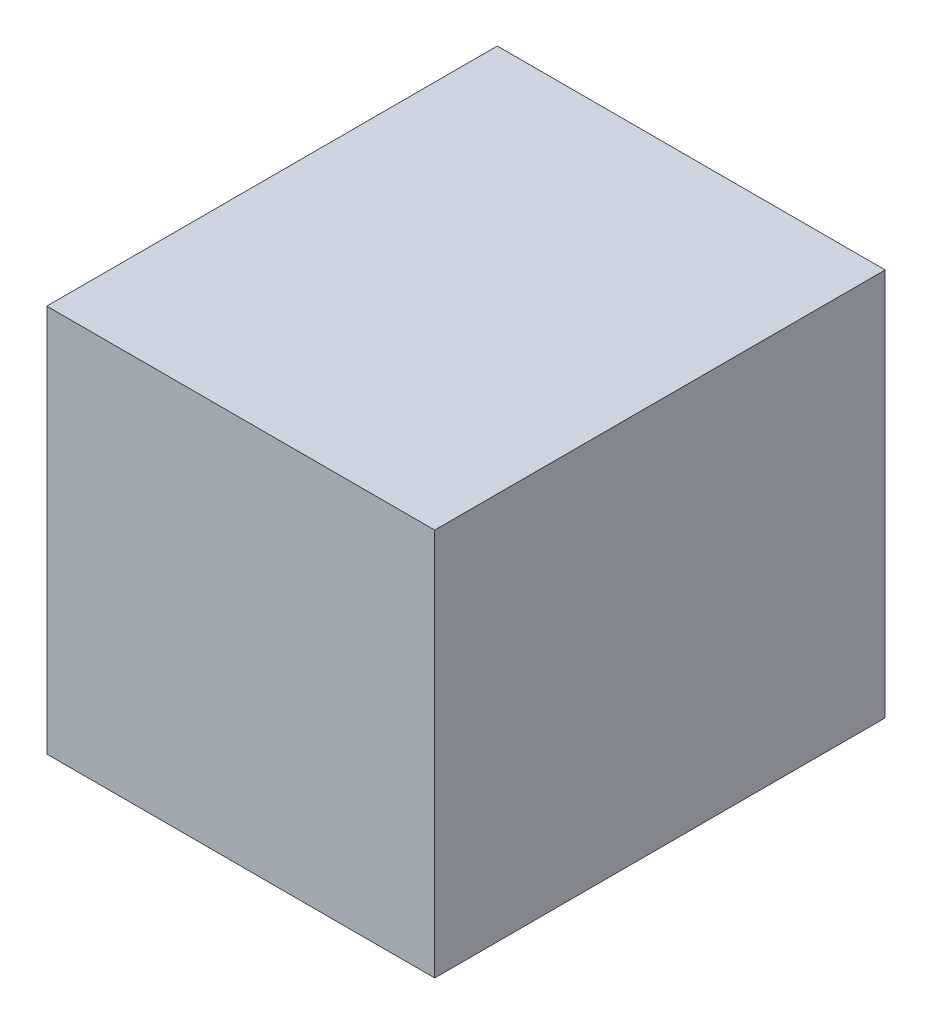
ISO-10303-21;
HEADER;
FILE_DESCRIPTION(('STEP AP214'),'2;1');
FILE_NAME('part.step','',(''),(''),'','','');
FILE_SCHEMA(('AUTOMOTIVE_DESIGN { 1 0 10303 214 1 1 1 1 }'));
ENDSEC;
DATA;
#1=APPLICATION_CONTEXT('core data for automotive mechanical design processes');
#2=APPLICATION_PROTOCOL_DEFINITION('international standard','automotive_design',2000,#1);
#3=PRODUCT_CONTEXT('',#1,'mechanical');
#4=PRODUCT('Part','Part','',(#3));
#5=PRODUCT_RELATED_PRODUCT_CATEGORY('part','',(#4));
#6=PRODUCT_DEFINITION_FORMATION('','',#4);
#7=PRODUCT_DEFINITION_CONTEXT('part definition',#1,'design');
#8=PRODUCT_DEFINITION('design','',#6,#7);
#9=PRODUCT_DEFINITION_SHAPE('','',#8);
#10=(LENGTH_UNIT() NAMED_UNIT(*) SI_UNIT(.MILLI.,.METRE.));
#11=(NAMED_UNIT(*) PLANE_ANGLE_UNIT() SI_UNIT($,.RADIAN.));
#12=(NAMED_UNIT(*) SI_UNIT($,.STERADIAN.) SOLID_ANGLE_UNIT());
#13=UNCERTAINTY_MEASURE_WITH_UNIT(LENGTH_MEASURE(1.E-05),#10,'distance_accuracy_value','');
#14=(GEOMETRIC_REPRESENTATION_CONTEXT(3) GLOBAL_UNCERTAINTY_ASSIGNED_CONTEXT((#13)) GLOBAL_UNIT_ASSIGNED_CONTEXT((#10,
#11,#12)) REPRESENTATION_CONTEXT('',''));
#15=CARTESIAN_POINT('',(0.,0.,0.));
#16=DIRECTION('',(0.,0.,1.));
#17=DIRECTION('',(1.,0.,0.));
#18=AXIS2_PLACEMENT_3D('',#15,#16,#17);
#19=CARTESIAN_POINT('',(-2.54,-5.08,0.2));
#20=DIRECTION('',(0.,1.,0.));
#21=DIRECTION('',(0.,0.,1.));
#22=AXIS2_PLACEMENT_3D('',#19,#20,#21);
#23=PLANE('',#22);
#24=DIRECTION('',(0.,0.,1.));
#25=VECTOR('',#24,1.);
#26=CARTESIAN_POINT('',(7.62,-5.08,0.2));
#27=LINE('',#26,#25);
#28=CARTESIAN_POINT('',(7.62,-5.08,0.2));
#29=VERTEX_POINT('',#28);
#30=CARTESIAN_POINT('',(7.62,-5.08,12.));
#31=VERTEX_POINT('',#30);
#32=EDGE_CURVE('E19',#29,#31,#27,.T.);
#33=ORIENTED_EDGE('',*,*,#32,.T.);
#34=DIRECTION('',(-1.,0.,0.));
#35=VECTOR('',#34,1.);
#36=CARTESIAN_POINT('',(7.62,-5.08,12.));
#37=LINE('',#36,#35);
#38=CARTESIAN_POINT('',(-2.54,-5.08,12.));
#39=VERTEX_POINT('',#38);
#40=EDGE_CURVE('E54',#31,#39,#37,.T.);
#41=ORIENTED_EDGE('',*,*,#40,.T.);
#42=DIRECTION('',(0.,0.,-1.));
#43=VECTOR('',#42,1.);
#44=CARTESIAN_POINT('',(-2.54,-5.08,0.2));
#45=LINE('',#44,#43);
#46=CARTESIAN_POINT('',(-2.54,-5.08,0.2));
#47=VERTEX_POINT('',#46);
#48=EDGE_CURVE('E75',#39,#47,#45,.T.);
#49=ORIENTED_EDGE('',*,*,#48,.T.);
#50=DIRECTION('',(-1.,0.,0.));
#51=VECTOR('',#50,1.);
#52=CARTESIAN_POINT('',(7.62,-5.08,0.2));
#53=LINE('',#52,#51);
#54=EDGE_CURVE('E57',#29,#47,#53,.T.);
#55=ORIENTED_EDGE('',*,*,#54,.F.);
#56=EDGE_LOOP('',(#33,#41,#49,#55));
#57=FACE_BOUND('',#56,.T.);
#58=ADVANCED_FACE('F16',(#57),#23,.F.);
#59=CARTESIAN_POINT('',(7.62,-5.08,0.2));
#60=DIRECTION('',(-1.,0.,0.));
#61=DIRECTION('',(0.,0.,1.));
#62=AXIS2_PLACEMENT_3D('',#59,#60,#61);
#63=PLANE('',#62);
#64=DIRECTION('',(0.,0.,-1.));
#65=VECTOR('',#64,1.);
#66=CARTESIAN_POINT('',(7.62,5.08,0.2));
#67=LINE('',#66,#65);
#68=CARTESIAN_POINT('',(7.62,5.08,0.2));
#69=VERTEX_POINT('',#68);
#70=CARTESIAN_POINT('',(7.62,5.08,12.));
#71=VERTEX_POINT('',#70);
#72=EDGE_CURVE('E72',#69,#71,#67,.F.);
#73=ORIENTED_EDGE('',*,*,#72,.T.);
#74=DIRECTION('',(0.,1.,0.));
#75=VECTOR('',#74,1.);
#76=CARTESIAN_POINT('',(7.62,5.08,12.));
#77=LINE('',#76,#75);
#78=EDGE_CURVE('E62',#71,#31,#77,.F.);
#79=ORIENTED_EDGE('',*,*,#78,.T.);
#80=ORIENTED_EDGE('',*,*,#32,.F.);
#81=DIRECTION('',(0.,1.,0.));
#82=VECTOR('',#81,1.);
#83=CARTESIAN_POINT('',(7.62,5.08,0.2));
#84=LINE('',#83,#82);
#85=EDGE_CURVE('E77',#69,#29,#84,.F.);
#86=ORIENTED_EDGE('',*,*,#85,.F.);
#87=EDGE_LOOP('',(#73,#79,#80,#86));
#88=FACE_BOUND('',#87,.T.);
#89=ADVANCED_FACE('F71',(#88),#63,.F.);
#90=CARTESIAN_POINT('',(7.62,5.08,12.));
#91=DIRECTION('',(0.,0.,-1.));
#92=DIRECTION('',(-1.,0.,0.));
#93=AXIS2_PLACEMENT_3D('',#90,#91,#92);
#94=PLANE('',#93);
#95=DIRECTION('',(0.,1.,0.));
#96=VECTOR('',#95,1.);
#97=CARTESIAN_POINT('',(-2.54,5.08,12.));
#98=LINE('',#97,#96);
#99=CARTESIAN_POINT('',(-2.54,5.08,12.));
#100=VERTEX_POINT('',#99);
#101=EDGE_CURVE('E68',#100,#39,#98,.F.);
#102=ORIENTED_EDGE('',*,*,#101,.T.);
#103=ORIENTED_EDGE('',*,*,#40,.F.);
#104=ORIENTED_EDGE('',*,*,#78,.F.);
#105=DIRECTION('',(1.,0.,0.));
#106=VECTOR('',#105,1.);
#107=CARTESIAN_POINT('',(7.62,5.08,12.));
#108=LINE('',#107,#106);
#109=EDGE_CURVE('E82',#71,#100,#108,.F.);
#110=ORIENTED_EDGE('',*,*,#109,.T.);
#111=EDGE_LOOP('',(#102,#103,#104,#110));
#112=FACE_BOUND('',#111,.T.);
#113=ADVANCED_FACE('F65',(#112),#94,.F.);
#114=CARTESIAN_POINT('',(-2.54,5.08,0.2));
#115=DIRECTION('',(1.,0.,0.));
#116=DIRECTION('',(0.,0.,-1.));
#117=AXIS2_PLACEMENT_3D('',#114,#115,#116);
#118=PLANE('',#117);
#119=ORIENTED_EDGE('',*,*,#48,.F.);
#120=ORIENTED_EDGE('',*,*,#101,.F.);
#121=DIRECTION('',(0.,0.,-1.));
#122=VECTOR('',#121,1.);
#123=CARTESIAN_POINT('',(-2.54,5.08,0.2));
#124=LINE('',#123,#122);
#125=CARTESIAN_POINT('',(-2.54,5.08,0.2));
#126=VERTEX_POINT('',#125);
#127=EDGE_CURVE('E25',#100,#126,#124,.T.);
#128=ORIENTED_EDGE('',*,*,#127,.T.);
#129=DIRECTION('',(0.,1.,0.));
#130=VECTOR('',#129,1.);
#131=CARTESIAN_POINT('',(-2.54,5.08,0.2));
#132=LINE('',#131,#130);
#133=EDGE_CURVE('E33',#47,#126,#132,.T.);
#134=ORIENTED_EDGE('',*,*,#133,.F.);
#135=EDGE_LOOP('',(#119,#120,#128,#134));
#136=FACE_BOUND('',#135,.T.);
#137=ADVANCED_FACE('F87',(#136),#118,.F.);
#138=CARTESIAN_POINT('',(7.62,5.08,0.2));
#139=DIRECTION('',(0.,0.,-1.));
#140=DIRECTION('',(-1.,0.,0.));
#141=AXIS2_PLACEMENT_3D('',#138,#139,#140);
#142=PLANE('',#141);
#143=ORIENTED_EDGE('',*,*,#133,.T.);
#144=DIRECTION('',(1.,0.,0.));
#145=VECTOR('',#144,1.);
#146=CARTESIAN_POINT('',(7.62,5.08,0.2));
#147=LINE('',#146,#145);
#148=EDGE_CURVE('E11',#126,#69,#147,.T.);
#149=ORIENTED_EDGE('',*,*,#148,.T.);
#150=ORIENTED_EDGE('',*,*,#85,.T.);
#151=ORIENTED_EDGE('',*,*,#54,.T.);
#152=EDGE_LOOP('',(#143,#149,#150,#151));
#153=FACE_BOUND('',#152,.T.);
#154=ADVANCED_FACE('F90',(#153),#142,.T.);
#155=CARTESIAN_POINT('',(7.62,5.08,0.2));
#156=DIRECTION('',(0.,-1.,0.));
#157=DIRECTION('',(0.,0.,-1.));
#158=AXIS2_PLACEMENT_3D('',#155,#156,#157);
#159=PLANE('',#158);
#160=ORIENTED_EDGE('',*,*,#127,.F.);
#161=ORIENTED_EDGE('',*,*,#109,.F.);
#162=ORIENTED_EDGE('',*,*,#72,.F.);
#163=ORIENTED_EDGE('',*,*,#148,.F.);
#164=EDGE_LOOP('',(#160,#161,#162,#163));
#165=FACE_BOUND('',#164,.T.);
#166=ADVANCED_FACE('F89',(#165),#159,.F.);
#167=CLOSED_SHELL('',(#58,#89,#113,#137,#154,#166));
#168=MANIFOLD_SOLID_BREP('B1',#167);
#169=ADVANCED_BREP_SHAPE_REPRESENTATION('',(#18,#168),#14);
#170=SHAPE_DEFINITION_REPRESENTATION(#9,#169);
ENDSEC;
END-ISO-10303-21;
